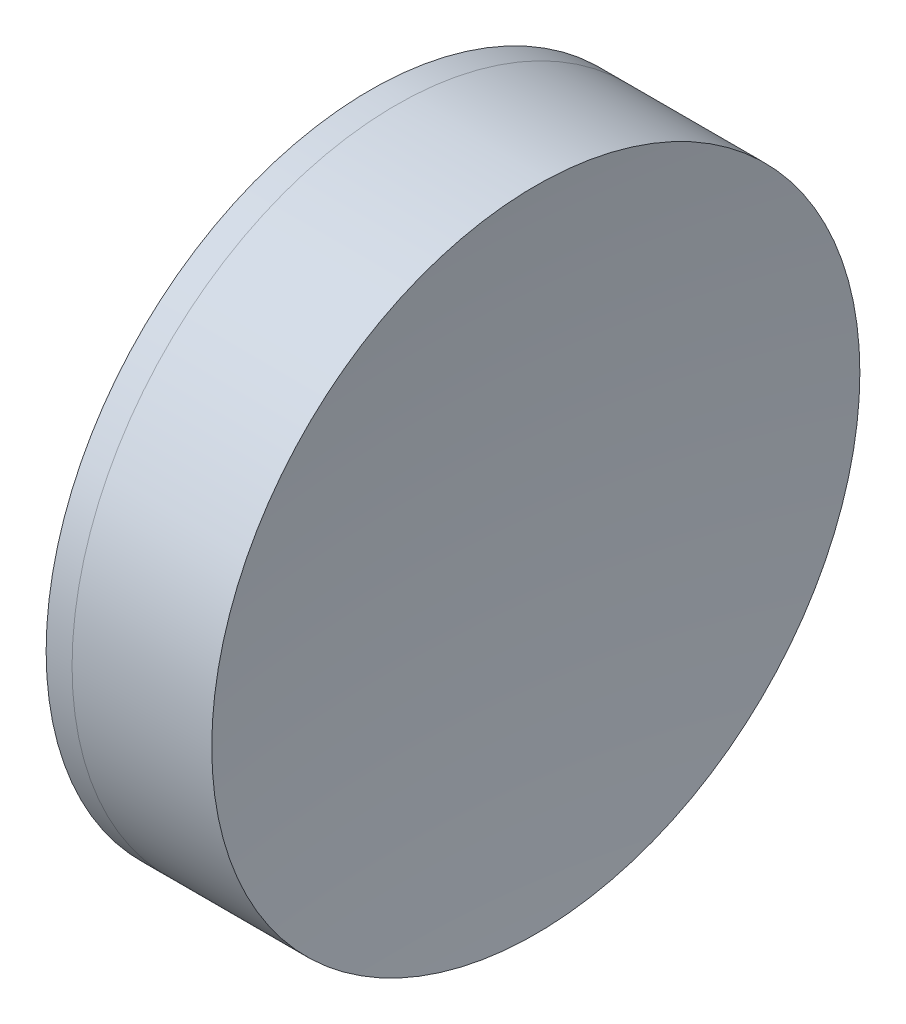
ISO-10303-21;
HEADER;
FILE_DESCRIPTION(('STEP AP214'),'2;1');
FILE_NAME('part.step','',(''),(''),'','','');
FILE_SCHEMA(('AUTOMOTIVE_DESIGN { 1 0 10303 214 1 1 1 1 }'));
ENDSEC;
DATA;
#1=APPLICATION_CONTEXT('core data for automotive mechanical design processes');
#2=APPLICATION_PROTOCOL_DEFINITION('international standard','automotive_design',2000,#1);
#3=PRODUCT_CONTEXT('',#1,'mechanical');
#4=PRODUCT('Part','Part','',(#3));
#5=PRODUCT_RELATED_PRODUCT_CATEGORY('part','',(#4));
#6=PRODUCT_DEFINITION_FORMATION('','',#4);
#7=PRODUCT_DEFINITION_CONTEXT('part definition',#1,'design');
#8=PRODUCT_DEFINITION('design','',#6,#7);
#9=PRODUCT_DEFINITION_SHAPE('','',#8);
#10=(LENGTH_UNIT() NAMED_UNIT(*) SI_UNIT(.MILLI.,.METRE.));
#11=(NAMED_UNIT(*) PLANE_ANGLE_UNIT() SI_UNIT($,.RADIAN.));
#12=(NAMED_UNIT(*) SI_UNIT($,.STERADIAN.) SOLID_ANGLE_UNIT());
#13=UNCERTAINTY_MEASURE_WITH_UNIT(LENGTH_MEASURE(1.E-05),#10,'distance_accuracy_value','');
#14=(GEOMETRIC_REPRESENTATION_CONTEXT(3) GLOBAL_UNCERTAINTY_ASSIGNED_CONTEXT((#13)) GLOBAL_UNIT_ASSIGNED_CONTEXT((#10,
#11,#12)) REPRESENTATION_CONTEXT('',''));
#15=CARTESIAN_POINT('',(0.,0.,0.));
#16=DIRECTION('',(0.,0.,1.));
#17=DIRECTION('',(1.,0.,0.));
#18=AXIS2_PLACEMENT_3D('',#15,#16,#17);
#19=CARTESIAN_POINT('',(5.82719809801224,0.,0.));
#20=DIRECTION('',(-1.,0.,0.));
#21=DIRECTION('',(0.,0.,1.));
#22=AXIS2_PLACEMENT_3D('',#19,#20,#21);
#23=SPHERICAL_SURFACE('',#22,47.5000000000001);
#24=CARTESIAN_POINT('',(51.5979311050333,0.,0.));
#25=DIRECTION('',(-1.,0.,0.));
#26=DIRECTION('',(0.,0.,1.));
#27=AXIS2_PLACEMENT_3D('',#24,#25,#26);
#28=CIRCLE('',#27,12.7);
#29=CARTESIAN_POINT('',(51.5979311050333,0.,12.7));
#30=VERTEX_POINT('',#29);
#31=EDGE_CURVE('E51',#30,#30,#28,.T.);
#32=ORIENTED_EDGE('',*,*,#31,.T.);
#33=EDGE_LOOP('',(#32));
#34=FACE_BOUND('',#33,.T.);
#35=ADVANCED_FACE('F45',(#34),#23,.F.);
#36=CARTESIAN_POINT('',(164.927198098012,0.,0.));
#37=DIRECTION('',(-1.,0.,0.));
#38=DIRECTION('',(0.,0.,-1.));
#39=AXIS2_PLACEMENT_3D('',#36,#37,#38);
#40=SPHERICAL_SURFACE('',#39,108.6);
#41=CARTESIAN_POINT('',(57.072341925469,0.,0.));
#42=DIRECTION('',(-1.,0.,0.));
#43=DIRECTION('',(0.,0.,1.));
#44=AXIS2_PLACEMENT_3D('',#41,#42,#43);
#45=CIRCLE('',#44,12.7);
#46=CARTESIAN_POINT('',(57.072341925469,0.,12.7));
#47=VERTEX_POINT('',#46);
#48=EDGE_CURVE('E11',#47,#47,#45,.T.);
#49=ORIENTED_EDGE('',*,*,#48,.F.);
#50=EDGE_LOOP('',(#49));
#51=FACE_BOUND('',#50,.T.);
#52=ADVANCED_FACE('F60',(#51),#40,.F.);
#53=CARTESIAN_POINT('',(-0.551919992657797,0.,0.));
#54=DIRECTION('',(-1.,0.,0.));
#55=DIRECTION('',(0.,0.,1.));
#56=AXIS2_PLACEMENT_3D('',#53,#54,#55);
#57=CYLINDRICAL_SURFACE('',#56,12.7);
#58=ORIENTED_EDGE('',*,*,#48,.T.);
#59=EDGE_LOOP('',(#58));
#60=FACE_BOUND('',#59,.T.);
#61=ORIENTED_EDGE('',*,*,#31,.F.);
#62=EDGE_LOOP('',(#61));
#63=FACE_BOUND('',#62,.T.);
#64=ADVANCED_FACE('F58',(#60,#63),#57,.T.);
#65=CLOSED_SHELL('',(#35,#52,#64));
#66=MANIFOLD_SOLID_BREP('B2',#65);
#67=CARTESIAN_POINT('',(85.2271980980122,0.,0.));
#68=DIRECTION('',(-1.,0.,0.));
#69=DIRECTION('',(0.,0.,-1.));
#70=AXIS2_PLACEMENT_3D('',#67,#68,#69);
#71=SPHERICAL_SURFACE('',#70,36.9);
#72=CARTESIAN_POINT('',(50.5815634523603,0.,0.));
#73=DIRECTION('',(-1.,0.,0.));
#74=DIRECTION('',(0.,0.,1.));
#75=AXIS2_PLACEMENT_3D('',#72,#73,#74);
#76=CIRCLE('',#75,12.7);
#77=CARTESIAN_POINT('',(50.5815634523603,0.,12.7));
#78=VERTEX_POINT('',#77);
#79=EDGE_CURVE('E44',#78,#78,#76,.T.);
#80=ORIENTED_EDGE('',*,*,#79,.T.);
#81=EDGE_LOOP('',(#80));
#82=FACE_BOUND('',#81,.T.);
#83=ADVANCED_FACE('F86',(#82),#71,.T.);
#84=CARTESIAN_POINT('',(-0.816062176165804,0.,0.));
#85=DIRECTION('',(-1.,0.,0.));
#86=DIRECTION('',(0.,0.,1.));
#87=AXIS2_PLACEMENT_3D('',#84,#85,#86);
#88=CYLINDRICAL_SURFACE('',#87,12.7);
#89=CARTESIAN_POINT('',(51.5979311050333,0.,0.));
#90=DIRECTION('',(-1.,0.,0.));
#91=DIRECTION('',(0.,0.,1.));
#92=AXIS2_PLACEMENT_3D('',#89,#90,#91);
#93=CIRCLE('',#92,12.7);
#94=CARTESIAN_POINT('',(51.5979311050333,0.,12.7));
#95=VERTEX_POINT('',#94);
#96=EDGE_CURVE('E92',#95,#95,#93,.T.);
#97=ORIENTED_EDGE('',*,*,#96,.T.);
#98=EDGE_LOOP('',(#97));
#99=FACE_BOUND('',#98,.T.);
#100=ORIENTED_EDGE('',*,*,#79,.F.);
#101=EDGE_LOOP('',(#100));
#102=FACE_BOUND('',#101,.T.);
#103=ADVANCED_FACE('F98',(#99,#102),#88,.T.);
#104=CARTESIAN_POINT('',(5.82719809801224,0.,0.));
#105=DIRECTION('',(-1.,0.,0.));
#106=DIRECTION('',(0.,0.,1.));
#107=AXIS2_PLACEMENT_3D('',#104,#105,#106);
#108=SPHERICAL_SURFACE('',#107,47.5000000000001);
#109=ORIENTED_EDGE('',*,*,#96,.F.);
#110=EDGE_LOOP('',(#109));
#111=FACE_BOUND('',#110,.T.);
#112=ADVANCED_FACE('F101',(#111),#108,.T.);
#113=CLOSED_SHELL('',(#83,#103,#112));
#114=MANIFOLD_SOLID_BREP('B6',#113);
#115=ADVANCED_BREP_SHAPE_REPRESENTATION('',(#18,#66,#114),#14);
#116=SHAPE_DEFINITION_REPRESENTATION(#9,#115);
ENDSEC;
END-ISO-10303-21;
